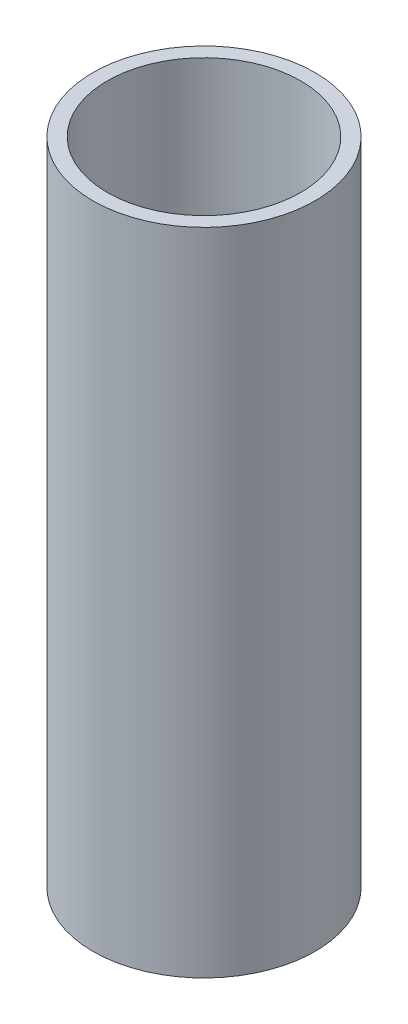
ISO-10303-21;
HEADER;
FILE_DESCRIPTION(('STEP AP214'),'2;1');
FILE_NAME('part.step','',(''),(''),'','','');
FILE_SCHEMA(('AUTOMOTIVE_DESIGN { 1 0 10303 214 1 1 1 1 }'));
ENDSEC;
DATA;
#1=APPLICATION_CONTEXT('core data for automotive mechanical design processes');
#2=APPLICATION_PROTOCOL_DEFINITION('international standard','automotive_design',2000,#1);
#3=PRODUCT_CONTEXT('',#1,'mechanical');
#4=PRODUCT('Part','Part','',(#3));
#5=PRODUCT_RELATED_PRODUCT_CATEGORY('part','',(#4));
#6=PRODUCT_DEFINITION_FORMATION('','',#4);
#7=PRODUCT_DEFINITION_CONTEXT('part definition',#1,'design');
#8=PRODUCT_DEFINITION('design','',#6,#7);
#9=PRODUCT_DEFINITION_SHAPE('','',#8);
#10=(LENGTH_UNIT() NAMED_UNIT(*) SI_UNIT(.MILLI.,.METRE.));
#11=(NAMED_UNIT(*) PLANE_ANGLE_UNIT() SI_UNIT($,.RADIAN.));
#12=(NAMED_UNIT(*) SI_UNIT($,.STERADIAN.) SOLID_ANGLE_UNIT());
#13=UNCERTAINTY_MEASURE_WITH_UNIT(LENGTH_MEASURE(1.E-05),#10,'distance_accuracy_value','');
#14=(GEOMETRIC_REPRESENTATION_CONTEXT(3) GLOBAL_UNCERTAINTY_ASSIGNED_CONTEXT((#13)) GLOBAL_UNIT_ASSIGNED_CONTEXT((#10,
#11,#12)) REPRESENTATION_CONTEXT('',''));
#15=CARTESIAN_POINT('',(0.,0.,0.));
#16=DIRECTION('',(0.,0.,1.));
#17=DIRECTION('',(1.,0.,0.));
#18=AXIS2_PLACEMENT_3D('',#15,#16,#17);
#19=CARTESIAN_POINT('',(0.,321.840778160302,0.));
#20=DIRECTION('',(0.,-1.,0.));
#21=DIRECTION('',(0.,0.,-1.));
#22=AXIS2_PLACEMENT_3D('',#19,#20,#21);
#23=CYLINDRICAL_SURFACE('',#22,55.);
#24=CARTESIAN_POINT('',(0.,321.840778160302,0.));
#25=DIRECTION('',(0.,1.,0.));
#26=DIRECTION('',(0.,0.,1.));
#27=AXIS2_PLACEMENT_3D('',#24,#25,#26);
#28=CIRCLE('',#27,55.);
#29=CARTESIAN_POINT('',(0.,321.840778160302,55.));
#30=VERTEX_POINT('',#29);
#31=EDGE_CURVE('E10',#30,#30,#28,.T.);
#32=ORIENTED_EDGE('',*,*,#31,.F.);
#33=EDGE_LOOP('',(#32));
#34=FACE_BOUND('',#33,.T.);
#35=CARTESIAN_POINT('',(0.,0.,0.));
#36=DIRECTION('',(0.,1.,0.));
#37=DIRECTION('',(0.,0.,1.));
#38=AXIS2_PLACEMENT_3D('',#35,#36,#37);
#39=CIRCLE('',#38,55.);
#40=CARTESIAN_POINT('',(0.,0.,55.));
#41=VERTEX_POINT('',#40);
#42=EDGE_CURVE('E37',#41,#41,#39,.T.);
#43=ORIENTED_EDGE('',*,*,#42,.T.);
#44=EDGE_LOOP('',(#43));
#45=FACE_BOUND('',#44,.T.);
#46=ADVANCED_FACE('F40',(#34,#45),#23,.T.);
#47=CARTESIAN_POINT('',(0.,321.840778160302,0.));
#48=DIRECTION('',(0.,1.,0.));
#49=DIRECTION('',(0.,0.,1.));
#50=AXIS2_PLACEMENT_3D('',#47,#48,#49);
#51=PLANE('',#50);
#52=CARTESIAN_POINT('',(0.,321.840778160302,0.));
#53=DIRECTION('',(0.,1.,0.));
#54=DIRECTION('',(0.,0.,1.));
#55=AXIS2_PLACEMENT_3D('',#52,#53,#54);
#56=CIRCLE('',#55,47.8937601151961);
#57=CARTESIAN_POINT('',(0.,321.840778160302,47.8937601151961));
#58=VERTEX_POINT('',#57);
#59=EDGE_CURVE('E50',#58,#58,#56,.T.);
#60=ORIENTED_EDGE('',*,*,#59,.F.);
#61=EDGE_LOOP('',(#60));
#62=FACE_BOUND('',#61,.T.);
#63=ORIENTED_EDGE('',*,*,#31,.T.);
#64=EDGE_LOOP('',(#63));
#65=FACE_BOUND('',#64,.T.);
#66=ADVANCED_FACE('F59',(#62,#65),#51,.T.);
#67=CARTESIAN_POINT('',(0.,0.,0.));
#68=DIRECTION('',(0.,1.,0.));
#69=DIRECTION('',(0.,0.,1.));
#70=AXIS2_PLACEMENT_3D('',#67,#68,#69);
#71=PLANE('',#70);
#72=CARTESIAN_POINT('',(0.,0.,0.));
#73=DIRECTION('',(0.,1.,0.));
#74=DIRECTION('',(0.,0.,1.));
#75=AXIS2_PLACEMENT_3D('',#72,#73,#74);
#76=CIRCLE('',#75,47.8937601151961);
#77=CARTESIAN_POINT('',(0.,0.,47.8937601151961));
#78=VERTEX_POINT('',#77);
#79=EDGE_CURVE('E47',#78,#78,#76,.T.);
#80=ORIENTED_EDGE('',*,*,#79,.T.);
#81=EDGE_LOOP('',(#80));
#82=FACE_BOUND('',#81,.T.);
#83=ORIENTED_EDGE('',*,*,#42,.F.);
#84=EDGE_LOOP('',(#83));
#85=FACE_BOUND('',#84,.T.);
#86=ADVANCED_FACE('F58',(#82,#85),#71,.F.);
#87=CARTESIAN_POINT('',(0.,321.840778160302,0.));
#88=DIRECTION('',(0.,-1.,0.));
#89=DIRECTION('',(0.,0.,-1.));
#90=AXIS2_PLACEMENT_3D('',#87,#88,#89);
#91=CYLINDRICAL_SURFACE('',#90,47.8937601151961);
#92=ORIENTED_EDGE('',*,*,#59,.T.);
#93=EDGE_LOOP('',(#92));
#94=FACE_BOUND('',#93,.T.);
#95=ORIENTED_EDGE('',*,*,#79,.F.);
#96=EDGE_LOOP('',(#95));
#97=FACE_BOUND('',#96,.T.);
#98=ADVANCED_FACE('F54',(#94,#97),#91,.F.);
#99=CLOSED_SHELL('',(#46,#66,#86,#98));
#100=MANIFOLD_SOLID_BREP('B2',#99);
#101=ADVANCED_BREP_SHAPE_REPRESENTATION('',(#18,#100),#14);
#102=SHAPE_DEFINITION_REPRESENTATION(#9,#101);
ENDSEC;
END-ISO-10303-21;
